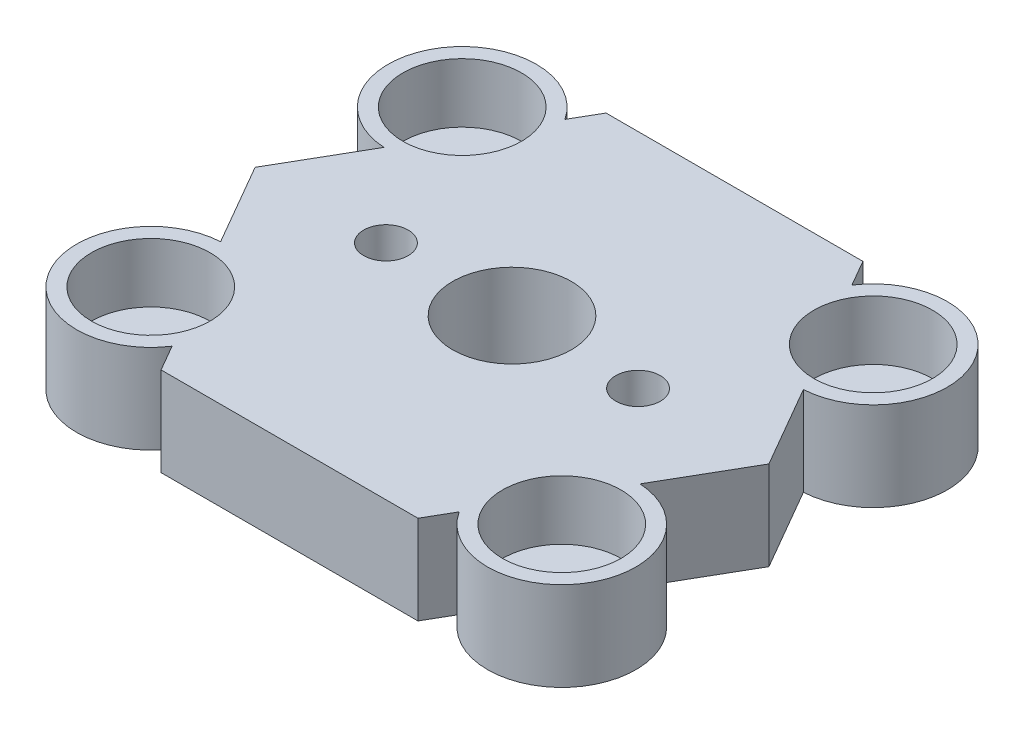
ISO-10303-21;
HEADER;
FILE_DESCRIPTION(('STEP AP214'),'2;1');
FILE_NAME('part.step','',(''),(''),'','','');
FILE_SCHEMA(('AUTOMOTIVE_DESIGN { 1 0 10303 214 1 1 1 1 }'));
ENDSEC;
DATA;
#1=APPLICATION_CONTEXT('core data for automotive mechanical design processes');
#2=APPLICATION_PROTOCOL_DEFINITION('international standard','automotive_design',2000,#1);
#3=PRODUCT_CONTEXT('',#1,'mechanical');
#4=PRODUCT('Part','Part','',(#3));
#5=PRODUCT_RELATED_PRODUCT_CATEGORY('part','',(#4));
#6=PRODUCT_DEFINITION_FORMATION('','',#4);
#7=PRODUCT_DEFINITION_CONTEXT('part definition',#1,'design');
#8=PRODUCT_DEFINITION('design','',#6,#7);
#9=PRODUCT_DEFINITION_SHAPE('','',#8);
#10=(LENGTH_UNIT() NAMED_UNIT(*) SI_UNIT(.MILLI.,.METRE.));
#11=(NAMED_UNIT(*) PLANE_ANGLE_UNIT() SI_UNIT($,.RADIAN.));
#12=(NAMED_UNIT(*) SI_UNIT($,.STERADIAN.) SOLID_ANGLE_UNIT());
#13=UNCERTAINTY_MEASURE_WITH_UNIT(LENGTH_MEASURE(1.E-05),#10,'distance_accuracy_value','');
#14=(GEOMETRIC_REPRESENTATION_CONTEXT(3) GLOBAL_UNCERTAINTY_ASSIGNED_CONTEXT((#13)) GLOBAL_UNIT_ASSIGNED_CONTEXT((#10,
#11,#12)) REPRESENTATION_CONTEXT('',''));
#15=CARTESIAN_POINT('',(0.,0.,0.));
#16=DIRECTION('',(0.,0.,1.));
#17=DIRECTION('',(1.,0.,0.));
#18=AXIS2_PLACEMENT_3D('',#15,#16,#17);
#19=CARTESIAN_POINT('',(-13.856406460551,6.,10.5));
#20=DIRECTION('',(0.,-1.,0.));
#21=DIRECTION('',(0.,0.,-1.));
#22=AXIS2_PLACEMENT_3D('',#19,#20,#21);
#23=CYLINDRICAL_SURFACE('',#22,1.5);
#24=CARTESIAN_POINT('',(-13.856406460551,0.,10.5));
#25=DIRECTION('',(0.,-1.,0.));
#26=DIRECTION('',(0.,0.,-1.));
#27=AXIS2_PLACEMENT_3D('',#24,#25,#26);
#28=CIRCLE('',#27,1.5);
#29=CARTESIAN_POINT('',(-13.856406460551,0.,9.));
#30=VERTEX_POINT('',#29);
#31=EDGE_CURVE('E500',#30,#30,#28,.T.);
#32=ORIENTED_EDGE('',*,*,#31,.T.);
#33=EDGE_LOOP('',(#32));
#34=FACE_BOUND('',#33,.T.);
#35=CARTESIAN_POINT('',(-13.856406460551,2.,10.5));
#36=DIRECTION('',(0.,1.,0.));
#37=DIRECTION('',(0.,0.,1.));
#38=AXIS2_PLACEMENT_3D('',#35,#36,#37);
#39=CIRCLE('',#38,1.5);
#40=CARTESIAN_POINT('',(-13.856406460551,2.,12.));
#41=VERTEX_POINT('',#40);
#42=EDGE_CURVE('E298',#41,#41,#39,.F.);
#43=ORIENTED_EDGE('',*,*,#42,.F.);
#44=EDGE_LOOP('',(#43));
#45=FACE_BOUND('',#44,.T.);
#46=ADVANCED_FACE('F294',(#34,#45),#23,.F.);
#47=CARTESIAN_POINT('',(13.856406460551,6.,10.5));
#48=DIRECTION('',(0.,-1.,0.));
#49=DIRECTION('',(0.,0.,-1.));
#50=AXIS2_PLACEMENT_3D('',#47,#48,#49);
#51=CYLINDRICAL_SURFACE('',#50,1.5);
#52=CARTESIAN_POINT('',(13.856406460551,0.,10.5));
#53=DIRECTION('',(0.,1.,0.));
#54=DIRECTION('',(0.,0.,1.));
#55=AXIS2_PLACEMENT_3D('',#52,#53,#54);
#56=CIRCLE('',#55,1.5);
#57=CARTESIAN_POINT('',(13.856406460551,0.,12.));
#58=VERTEX_POINT('',#57);
#59=EDGE_CURVE('E509',#58,#58,#56,.T.);
#60=ORIENTED_EDGE('',*,*,#59,.F.);
#61=EDGE_LOOP('',(#60));
#62=FACE_BOUND('',#61,.T.);
#63=CARTESIAN_POINT('',(13.856406460551,2.,10.5));
#64=DIRECTION('',(0.,1.,0.));
#65=DIRECTION('',(0.,0.,1.));
#66=AXIS2_PLACEMENT_3D('',#63,#64,#65);
#67=CIRCLE('',#66,1.5);
#68=CARTESIAN_POINT('',(13.856406460551,2.,12.));
#69=VERTEX_POINT('',#68);
#70=EDGE_CURVE('E537',#69,#69,#67,.T.);
#71=ORIENTED_EDGE('',*,*,#70,.T.);
#72=EDGE_LOOP('',(#71));
#73=FACE_BOUND('',#72,.T.);
#74=ADVANCED_FACE('F607',(#62,#73),#51,.F.);
#75=CARTESIAN_POINT('',(13.856406460551,6.,-10.5));
#76=DIRECTION('',(0.,-1.,0.));
#77=DIRECTION('',(0.,0.,-1.));
#78=AXIS2_PLACEMENT_3D('',#75,#76,#77);
#79=CYLINDRICAL_SURFACE('',#78,1.5);
#80=CARTESIAN_POINT('',(13.856406460551,0.,-10.5));
#81=DIRECTION('',(0.,-1.,0.));
#82=DIRECTION('',(0.,0.,-1.));
#83=AXIS2_PLACEMENT_3D('',#80,#81,#82);
#84=CIRCLE('',#83,1.5);
#85=CARTESIAN_POINT('',(13.856406460551,0.,-12.));
#86=VERTEX_POINT('',#85);
#87=EDGE_CURVE('E516',#86,#86,#84,.T.);
#88=ORIENTED_EDGE('',*,*,#87,.T.);
#89=EDGE_LOOP('',(#88));
#90=FACE_BOUND('',#89,.T.);
#91=CARTESIAN_POINT('',(13.856406460551,2.,-10.5));
#92=DIRECTION('',(0.,1.,0.));
#93=DIRECTION('',(0.,0.,1.));
#94=AXIS2_PLACEMENT_3D('',#91,#92,#93);
#95=CIRCLE('',#94,1.5);
#96=CARTESIAN_POINT('',(13.856406460551,2.,-9.));
#97=VERTEX_POINT('',#96);
#98=EDGE_CURVE('E534',#97,#97,#95,.F.);
#99=ORIENTED_EDGE('',*,*,#98,.F.);
#100=EDGE_LOOP('',(#99));
#101=FACE_BOUND('',#100,.T.);
#102=ADVANCED_FACE('F613',(#90,#101),#79,.F.);
#103=CARTESIAN_POINT('',(-13.856406460551,6.,-10.5));
#104=DIRECTION('',(0.,-1.,0.));
#105=DIRECTION('',(0.,0.,-1.));
#106=AXIS2_PLACEMENT_3D('',#103,#104,#105);
#107=CYLINDRICAL_SURFACE('',#106,1.5);
#108=CARTESIAN_POINT('',(-13.856406460551,0.,-10.5));
#109=DIRECTION('',(0.,1.,0.));
#110=DIRECTION('',(0.,0.,1.));
#111=AXIS2_PLACEMENT_3D('',#108,#109,#110);
#112=CIRCLE('',#111,1.5);
#113=CARTESIAN_POINT('',(-13.856406460551,0.,-9.));
#114=VERTEX_POINT('',#113);
#115=EDGE_CURVE('E424',#114,#114,#112,.T.);
#116=ORIENTED_EDGE('',*,*,#115,.F.);
#117=EDGE_LOOP('',(#116));
#118=FACE_BOUND('',#117,.T.);
#119=CARTESIAN_POINT('',(-13.856406460551,2.,-10.5));
#120=DIRECTION('',(0.,1.,0.));
#121=DIRECTION('',(0.,0.,1.));
#122=AXIS2_PLACEMENT_3D('',#119,#120,#121);
#123=CIRCLE('',#122,1.5);
#124=CARTESIAN_POINT('',(-13.856406460551,2.,-9.));
#125=VERTEX_POINT('',#124);
#126=EDGE_CURVE('E531',#125,#125,#123,.T.);
#127=ORIENTED_EDGE('',*,*,#126,.T.);
#128=EDGE_LOOP('',(#127));
#129=FACE_BOUND('',#128,.T.);
#130=ADVANCED_FACE('F629',(#118,#129),#107,.F.);
#131=CARTESIAN_POINT('',(-8.5,6.,0.));
#132=DIRECTION('',(0.,-1.,0.));
#133=DIRECTION('',(0.,0.,-1.));
#134=AXIS2_PLACEMENT_3D('',#131,#132,#133);
#135=CYLINDRICAL_SURFACE('',#134,1.5);
#136=CARTESIAN_POINT('',(-8.5,6.,0.));
#137=DIRECTION('',(0.,1.,0.));
#138=DIRECTION('',(0.,0.,1.));
#139=AXIS2_PLACEMENT_3D('',#136,#137,#138);
#140=CIRCLE('',#139,1.5);
#141=CARTESIAN_POINT('',(-8.5,6.,1.5));
#142=VERTEX_POINT('',#141);
#143=EDGE_CURVE('E429',#142,#142,#140,.T.);
#144=ORIENTED_EDGE('',*,*,#143,.T.);
#145=EDGE_LOOP('',(#144));
#146=FACE_BOUND('',#145,.T.);
#147=CARTESIAN_POINT('',(-8.5,3.,0.));
#148=DIRECTION('',(0.,-1.,0.));
#149=DIRECTION('',(0.,0.,-1.));
#150=AXIS2_PLACEMENT_3D('',#147,#148,#149);
#151=CIRCLE('',#150,1.5);
#152=CARTESIAN_POINT('',(-8.5,3.,-1.5));
#153=VERTEX_POINT('',#152);
#154=EDGE_CURVE('E520',#153,#153,#151,.T.);
#155=ORIENTED_EDGE('',*,*,#154,.T.);
#156=EDGE_LOOP('',(#155));
#157=FACE_BOUND('',#156,.T.);
#158=ADVANCED_FACE('F634',(#146,#157),#135,.F.);
#159=CARTESIAN_POINT('',(8.5,6.,0.));
#160=DIRECTION('',(0.,-1.,0.));
#161=DIRECTION('',(0.,0.,-1.));
#162=AXIS2_PLACEMENT_3D('',#159,#160,#161);
#163=CYLINDRICAL_SURFACE('',#162,1.5);
#164=CARTESIAN_POINT('',(8.5,6.,0.));
#165=DIRECTION('',(0.,1.,0.));
#166=DIRECTION('',(0.,0.,1.));
#167=AXIS2_PLACEMENT_3D('',#164,#165,#166);
#168=CIRCLE('',#167,1.5);
#169=CARTESIAN_POINT('',(8.5,6.,1.5));
#170=VERTEX_POINT('',#169);
#171=EDGE_CURVE('E432',#170,#170,#168,.T.);
#172=ORIENTED_EDGE('',*,*,#171,.T.);
#173=EDGE_LOOP('',(#172));
#174=FACE_BOUND('',#173,.T.);
#175=CARTESIAN_POINT('',(8.5,3.,0.));
#176=DIRECTION('',(0.,-1.,0.));
#177=DIRECTION('',(0.,0.,-1.));
#178=AXIS2_PLACEMENT_3D('',#175,#176,#177);
#179=CIRCLE('',#178,1.5);
#180=CARTESIAN_POINT('',(8.5,3.,-1.5));
#181=VERTEX_POINT('',#180);
#182=EDGE_CURVE('E525',#181,#181,#179,.T.);
#183=ORIENTED_EDGE('',*,*,#182,.T.);
#184=EDGE_LOOP('',(#183));
#185=FACE_BOUND('',#184,.T.);
#186=ADVANCED_FACE('F624',(#174,#185),#163,.F.);
#187=CARTESIAN_POINT('',(-13.856406460551,6.,10.5));
#188=DIRECTION('',(0.,-1.,0.));
#189=DIRECTION('',(0.,0.,-1.));
#190=AXIS2_PLACEMENT_3D('',#187,#188,#189);
#191=CYLINDRICAL_SURFACE('',#190,5.);
#192=DIRECTION('',(0.,-1.,0.));
#193=VECTOR('',#192,1.);
#194=CARTESIAN_POINT('',(-9.67527791459956,6.,13.2419270745645));
#195=LINE('',#194,#193);
#196=CARTESIAN_POINT('',(-9.67527791459956,6.,13.2419270745645));
#197=VERTEX_POINT('',#196);
#198=CARTESIAN_POINT('',(-9.67527791459956,0.,13.2419270745645));
#199=VERTEX_POINT('',#198);
#200=EDGE_CURVE('E492',#197,#199,#195,.T.);
#201=ORIENTED_EDGE('',*,*,#200,.F.);
#202=CARTESIAN_POINT('',(-13.856406460551,6.,10.5));
#203=DIRECTION('',(0.,-1.,0.));
#204=DIRECTION('',(0.,0.,-1.));
#205=AXIS2_PLACEMENT_3D('',#202,#203,#204);
#206=CIRCLE('',#205,5.);
#207=CARTESIAN_POINT('',(-14.1404206894725,6.,5.50807292543548));
#208=VERTEX_POINT('',#207);
#209=EDGE_CURVE('E433',#197,#208,#206,.T.);
#210=ORIENTED_EDGE('',*,*,#209,.T.);
#211=DIRECTION('',(0.,-1.,0.));
#212=VECTOR('',#211,1.);
#213=CARTESIAN_POINT('',(-14.1404206894725,6.,5.50807292543548));
#214=LINE('',#213,#212);
#215=CARTESIAN_POINT('',(-14.1404206894725,0.,5.50807292543548));
#216=VERTEX_POINT('',#215);
#217=EDGE_CURVE('E490',#216,#208,#214,.F.);
#218=ORIENTED_EDGE('',*,*,#217,.F.);
#219=CARTESIAN_POINT('',(-13.856406460551,0.,10.5));
#220=DIRECTION('',(0.,-1.,0.));
#221=DIRECTION('',(0.,0.,-1.));
#222=AXIS2_PLACEMENT_3D('',#219,#220,#221);
#223=CIRCLE('',#222,5.);
#224=EDGE_CURVE('E503',#199,#216,#223,.T.);
#225=ORIENTED_EDGE('',*,*,#224,.F.);
#226=EDGE_LOOP('',(#201,#210,#218,#225));
#227=FACE_BOUND('',#226,.T.);
#228=ADVANCED_FACE('F621',(#227),#191,.T.);
#229=CARTESIAN_POINT('',(13.856406460551,6.,10.5));
#230=DIRECTION('',(0.,-1.,0.));
#231=DIRECTION('',(0.,0.,-1.));
#232=AXIS2_PLACEMENT_3D('',#229,#230,#231);
#233=CYLINDRICAL_SURFACE('',#232,5.);
#234=CARTESIAN_POINT('',(13.856406460551,0.,10.5));
#235=DIRECTION('',(0.,1.,0.));
#236=DIRECTION('',(0.,0.,1.));
#237=AXIS2_PLACEMENT_3D('',#234,#235,#236);
#238=CIRCLE('',#237,5.);
#239=CARTESIAN_POINT('',(9.67527791459957,0.,13.2419270745645));
#240=VERTEX_POINT('',#239);
#241=CARTESIAN_POINT('',(14.1404206894725,0.,5.50807292543549));
#242=VERTEX_POINT('',#241);
#243=EDGE_CURVE('E512',#240,#242,#238,.T.);
#244=ORIENTED_EDGE('',*,*,#243,.T.);
#245=DIRECTION('',(0.,-1.,0.));
#246=VECTOR('',#245,1.);
#247=CARTESIAN_POINT('',(14.1404206894725,6.,5.5080729254355));
#248=LINE('',#247,#246);
#249=CARTESIAN_POINT('',(14.1404206894725,6.,5.50807292543549));
#250=VERTEX_POINT('',#249);
#251=EDGE_CURVE('E393',#242,#250,#248,.F.);
#252=ORIENTED_EDGE('',*,*,#251,.T.);
#253=CARTESIAN_POINT('',(13.856406460551,6.,10.5));
#254=DIRECTION('',(0.,1.,0.));
#255=DIRECTION('',(0.,0.,1.));
#256=AXIS2_PLACEMENT_3D('',#253,#254,#255);
#257=CIRCLE('',#256,5.);
#258=CARTESIAN_POINT('',(9.67527791459957,6.,13.2419270745645));
#259=VERTEX_POINT('',#258);
#260=EDGE_CURVE('E504',#259,#250,#257,.T.);
#261=ORIENTED_EDGE('',*,*,#260,.F.);
#262=DIRECTION('',(0.,-1.,0.));
#263=VECTOR('',#262,1.);
#264=CARTESIAN_POINT('',(9.67527791459957,6.,13.2419270745645));
#265=LINE('',#264,#263);
#266=EDGE_CURVE('E387',#259,#240,#265,.T.);
#267=ORIENTED_EDGE('',*,*,#266,.T.);
#268=EDGE_LOOP('',(#244,#252,#261,#267));
#269=FACE_BOUND('',#268,.T.);
#270=ADVANCED_FACE('F623',(#269),#233,.T.);
#271=CARTESIAN_POINT('',(13.856406460551,6.,-10.5));
#272=DIRECTION('',(0.,-1.,0.));
#273=DIRECTION('',(0.,0.,-1.));
#274=AXIS2_PLACEMENT_3D('',#271,#272,#273);
#275=CYLINDRICAL_SURFACE('',#274,5.);
#276=DIRECTION('',(0.,-1.,0.));
#277=VECTOR('',#276,1.);
#278=CARTESIAN_POINT('',(9.67527791459956,6.,-13.2419270745645));
#279=LINE('',#278,#277);
#280=CARTESIAN_POINT('',(9.67527791459956,6.,-13.2419270745645));
#281=VERTEX_POINT('',#280);
#282=CARTESIAN_POINT('',(9.67527791459956,0.,-13.2419270745645));
#283=VERTEX_POINT('',#282);
#284=EDGE_CURVE('E496',#281,#283,#279,.T.);
#285=ORIENTED_EDGE('',*,*,#284,.F.);
#286=CARTESIAN_POINT('',(13.856406460551,6.,-10.5));
#287=DIRECTION('',(0.,-1.,0.));
#288=DIRECTION('',(0.,0.,-1.));
#289=AXIS2_PLACEMENT_3D('',#286,#287,#288);
#290=CIRCLE('',#289,5.);
#291=CARTESIAN_POINT('',(14.1404206894725,6.,-5.50807292543549));
#292=VERTEX_POINT('',#291);
#293=EDGE_CURVE('E513',#281,#292,#290,.T.);
#294=ORIENTED_EDGE('',*,*,#293,.T.);
#295=DIRECTION('',(0.,-1.,0.));
#296=VECTOR('',#295,1.);
#297=CARTESIAN_POINT('',(14.1404206894725,6.,-5.50807292543549));
#298=LINE('',#297,#296);
#299=CARTESIAN_POINT('',(14.1404206894725,0.,-5.50807292543549));
#300=VERTEX_POINT('',#299);
#301=EDGE_CURVE('E494',#300,#292,#298,.F.);
#302=ORIENTED_EDGE('',*,*,#301,.F.);
#303=CARTESIAN_POINT('',(13.856406460551,0.,-10.5));
#304=DIRECTION('',(0.,-1.,0.));
#305=DIRECTION('',(0.,0.,-1.));
#306=AXIS2_PLACEMENT_3D('',#303,#304,#305);
#307=CIRCLE('',#306,5.);
#308=EDGE_CURVE('E519',#283,#300,#307,.T.);
#309=ORIENTED_EDGE('',*,*,#308,.F.);
#310=EDGE_LOOP('',(#285,#294,#302,#309));
#311=FACE_BOUND('',#310,.T.);
#312=ADVANCED_FACE('F296',(#311),#275,.T.);
#313=CARTESIAN_POINT('',(0.,6.,0.));
#314=DIRECTION('',(0.,-1.,0.));
#315=DIRECTION('',(0.,0.,-1.));
#316=AXIS2_PLACEMENT_3D('',#313,#314,#315);
#317=CYLINDRICAL_SURFACE('',#316,4.);
#318=CARTESIAN_POINT('',(0.,6.,0.));
#319=DIRECTION('',(0.,1.,0.));
#320=DIRECTION('',(0.,0.,1.));
#321=AXIS2_PLACEMENT_3D('',#318,#319,#320);
#322=CIRCLE('',#321,4.);
#323=CARTESIAN_POINT('',(0.,6.,4.));
#324=VERTEX_POINT('',#323);
#325=EDGE_CURVE('E437',#324,#324,#322,.T.);
#326=ORIENTED_EDGE('',*,*,#325,.T.);
#327=EDGE_LOOP('',(#326));
#328=FACE_BOUND('',#327,.T.);
#329=CARTESIAN_POINT('',(0.,0.,0.));
#330=DIRECTION('',(0.,1.,0.));
#331=DIRECTION('',(0.,0.,1.));
#332=AXIS2_PLACEMENT_3D('',#329,#330,#331);
#333=CIRCLE('',#332,4.);
#334=CARTESIAN_POINT('',(0.,0.,4.));
#335=VERTEX_POINT('',#334);
#336=EDGE_CURVE('E436',#335,#335,#333,.T.);
#337=ORIENTED_EDGE('',*,*,#336,.F.);
#338=EDGE_LOOP('',(#337));
#339=FACE_BOUND('',#338,.T.);
#340=ADVANCED_FACE('F870',(#328,#339),#317,.F.);
#341=CARTESIAN_POINT('',(-17.3205080756888,6.,0.));
#342=DIRECTION('',(0.866025403784438,0.,-0.5));
#343=DIRECTION('',(-0.5,0.,-0.866025403784439));
#344=AXIS2_PLACEMENT_3D('',#341,#342,#343);
#345=PLANE('',#344);
#346=DIRECTION('',(0.5,0.,0.866025403784438));
#347=VECTOR('',#346,1.);
#348=CARTESIAN_POINT('',(-17.3205080756888,0.,0.));
#349=LINE('',#348,#347);
#350=CARTESIAN_POINT('',(-17.3205080756888,0.,0.));
#351=VERTEX_POINT('',#350);
#352=EDGE_CURVE('E470',#351,#216,#349,.T.);
#353=ORIENTED_EDGE('',*,*,#352,.T.);
#354=ORIENTED_EDGE('',*,*,#217,.T.);
#355=DIRECTION('',(0.5,0.,0.866025403784438));
#356=VECTOR('',#355,1.);
#357=CARTESIAN_POINT('',(-17.3205080756888,6.,0.));
#358=LINE('',#357,#356);
#359=CARTESIAN_POINT('',(-17.3205080756888,6.,0.));
#360=VERTEX_POINT('',#359);
#361=EDGE_CURVE('E453',#360,#208,#358,.T.);
#362=ORIENTED_EDGE('',*,*,#361,.F.);
#363=DIRECTION('',(0.,-1.,0.));
#364=VECTOR('',#363,1.);
#365=CARTESIAN_POINT('',(-17.3205080756888,6.,0.));
#366=LINE('',#365,#364);
#367=EDGE_CURVE('E413',#360,#351,#366,.T.);
#368=ORIENTED_EDGE('',*,*,#367,.T.);
#369=EDGE_LOOP('',(#353,#354,#362,#368));
#370=FACE_BOUND('',#369,.T.);
#371=ADVANCED_FACE('F860',(#370),#345,.F.);
#372=CARTESIAN_POINT('',(-8.66025403784438,6.,15.));
#373=VERTEX_POINT('',#372);
#374=EDGE_CURVE('E452',#197,#373,#358,.T.);
#375=ORIENTED_EDGE('',*,*,#374,.F.);
#376=ORIENTED_EDGE('',*,*,#200,.T.);
#377=CARTESIAN_POINT('',(-8.66025403784438,0.,15.));
#378=VERTEX_POINT('',#377);
#379=EDGE_CURVE('E469',#199,#378,#349,.T.);
#380=ORIENTED_EDGE('',*,*,#379,.T.);
#381=DIRECTION('',(0.,-1.,0.));
#382=VECTOR('',#381,1.);
#383=CARTESIAN_POINT('',(-8.66025403784438,6.,15.));
#384=LINE('',#383,#382);
#385=EDGE_CURVE('E477',#373,#378,#384,.T.);
#386=ORIENTED_EDGE('',*,*,#385,.F.);
#387=EDGE_LOOP('',(#375,#376,#380,#386));
#388=FACE_BOUND('',#387,.T.);
#389=ADVANCED_FACE('F850',(#388),#345,.F.);
#390=CARTESIAN_POINT('',(-8.66025403784438,6.,15.));
#391=DIRECTION('',(0.,0.,-1.));
#392=DIRECTION('',(-1.,0.,0.));
#393=AXIS2_PLACEMENT_3D('',#390,#391,#392);
#394=PLANE('',#393);
#395=DIRECTION('',(1.,0.,0.));
#396=VECTOR('',#395,1.);
#397=CARTESIAN_POINT('',(-8.66025403784438,0.,15.));
#398=LINE('',#397,#396);
#399=CARTESIAN_POINT('',(8.66025403784439,0.,15.));
#400=VERTEX_POINT('',#399);
#401=EDGE_CURVE('E473',#378,#400,#398,.T.);
#402=ORIENTED_EDGE('',*,*,#401,.T.);
#403=DIRECTION('',(0.,-1.,0.));
#404=VECTOR('',#403,1.);
#405=CARTESIAN_POINT('',(8.66025403784439,6.,15.));
#406=LINE('',#405,#404);
#407=CARTESIAN_POINT('',(8.66025403784439,6.,15.));
#408=VERTEX_POINT('',#407);
#409=EDGE_CURVE('E457',#408,#400,#406,.T.);
#410=ORIENTED_EDGE('',*,*,#409,.F.);
#411=DIRECTION('',(1.,0.,0.));
#412=VECTOR('',#411,1.);
#413=CARTESIAN_POINT('',(-8.66025403784438,6.,15.));
#414=LINE('',#413,#412);
#415=EDGE_CURVE('E455',#373,#408,#414,.T.);
#416=ORIENTED_EDGE('',*,*,#415,.F.);
#417=ORIENTED_EDGE('',*,*,#385,.T.);
#418=EDGE_LOOP('',(#402,#410,#416,#417));
#419=FACE_BOUND('',#418,.T.);
#420=ADVANCED_FACE('F842',(#419),#394,.F.);
#421=CARTESIAN_POINT('',(8.66025403784439,6.,15.));
#422=DIRECTION('',(-0.866025403784439,0.,-0.5));
#423=DIRECTION('',(-0.5,0.,0.866025403784439));
#424=AXIS2_PLACEMENT_3D('',#421,#422,#423);
#425=PLANE('',#424);
#426=ORIENTED_EDGE('',*,*,#266,.F.);
#427=DIRECTION('',(0.5,0.,-0.866025403784439));
#428=VECTOR('',#427,1.);
#429=CARTESIAN_POINT('',(8.66025403784439,6.,15.));
#430=LINE('',#429,#428);
#431=EDGE_CURVE('E443',#408,#259,#430,.T.);
#432=ORIENTED_EDGE('',*,*,#431,.F.);
#433=ORIENTED_EDGE('',*,*,#409,.T.);
#434=DIRECTION('',(0.5,0.,-0.866025403784439));
#435=VECTOR('',#434,1.);
#436=CARTESIAN_POINT('',(8.66025403784439,0.,15.));
#437=LINE('',#436,#435);
#438=EDGE_CURVE('E458',#400,#240,#437,.T.);
#439=ORIENTED_EDGE('',*,*,#438,.T.);
#440=EDGE_LOOP('',(#426,#432,#433,#439));
#441=FACE_BOUND('',#440,.T.);
#442=ADVANCED_FACE('F833',(#441),#425,.F.);
#443=ORIENTED_EDGE('',*,*,#251,.F.);
#444=CARTESIAN_POINT('',(17.3205080756888,0.,0.));
#445=VERTEX_POINT('',#444);
#446=EDGE_CURVE('E440',#242,#445,#437,.T.);
#447=ORIENTED_EDGE('',*,*,#446,.T.);
#448=DIRECTION('',(0.,-1.,0.));
#449=VECTOR('',#448,1.);
#450=CARTESIAN_POINT('',(17.3205080756888,6.,0.));
#451=LINE('',#450,#449);
#452=CARTESIAN_POINT('',(17.3205080756888,6.,0.));
#453=VERTEX_POINT('',#452);
#454=EDGE_CURVE('E487',#453,#445,#451,.T.);
#455=ORIENTED_EDGE('',*,*,#454,.F.);
#456=EDGE_CURVE('E447',#250,#453,#430,.T.);
#457=ORIENTED_EDGE('',*,*,#456,.F.);
#458=EDGE_LOOP('',(#443,#447,#455,#457));
#459=FACE_BOUND('',#458,.T.);
#460=ADVANCED_FACE('F619',(#459),#425,.F.);
#461=CARTESIAN_POINT('',(17.3205080756888,6.,0.));
#462=DIRECTION('',(-0.866025403784438,0.,0.5));
#463=DIRECTION('',(0.5,0.,0.866025403784439));
#464=AXIS2_PLACEMENT_3D('',#461,#462,#463);
#465=PLANE('',#464);
#466=DIRECTION('',(-0.5,0.,-0.866025403784438));
#467=VECTOR('',#466,1.);
#468=CARTESIAN_POINT('',(17.3205080756888,0.,0.));
#469=LINE('',#468,#467);
#470=EDGE_CURVE('E461',#445,#300,#469,.T.);
#471=ORIENTED_EDGE('',*,*,#470,.T.);
#472=ORIENTED_EDGE('',*,*,#301,.T.);
#473=DIRECTION('',(-0.5,0.,-0.866025403784438));
#474=VECTOR('',#473,1.);
#475=CARTESIAN_POINT('',(17.3205080756888,6.,0.));
#476=LINE('',#475,#474);
#477=EDGE_CURVE('E448',#453,#292,#476,.T.);
#478=ORIENTED_EDGE('',*,*,#477,.F.);
#479=ORIENTED_EDGE('',*,*,#454,.T.);
#480=EDGE_LOOP('',(#471,#472,#478,#479));
#481=FACE_BOUND('',#480,.T.);
#482=ADVANCED_FACE('F816',(#481),#465,.F.);
#483=CARTESIAN_POINT('',(8.66025403784438,6.,-15.));
#484=VERTEX_POINT('',#483);
#485=EDGE_CURVE('E446',#281,#484,#476,.T.);
#486=ORIENTED_EDGE('',*,*,#485,.F.);
#487=ORIENTED_EDGE('',*,*,#284,.T.);
#488=CARTESIAN_POINT('',(8.66025403784438,0.,-15.));
#489=VERTEX_POINT('',#488);
#490=EDGE_CURVE('E460',#283,#489,#469,.T.);
#491=ORIENTED_EDGE('',*,*,#490,.T.);
#492=DIRECTION('',(0.,-1.,0.));
#493=VECTOR('',#492,1.);
#494=CARTESIAN_POINT('',(8.66025403784438,6.,-15.));
#495=LINE('',#494,#493);
#496=EDGE_CURVE('E484',#484,#489,#495,.T.);
#497=ORIENTED_EDGE('',*,*,#496,.F.);
#498=EDGE_LOOP('',(#486,#487,#491,#497));
#499=FACE_BOUND('',#498,.T.);
#500=ADVANCED_FACE('F806',(#499),#465,.F.);
#501=CARTESIAN_POINT('',(8.66025403784438,6.,-15.));
#502=DIRECTION('',(0.,0.,1.));
#503=DIRECTION('',(1.,0.,0.));
#504=AXIS2_PLACEMENT_3D('',#501,#502,#503);
#505=PLANE('',#504);
#506=DIRECTION('',(-1.,0.,0.));
#507=VECTOR('',#506,1.);
#508=CARTESIAN_POINT('',(8.66025403784438,0.,-15.));
#509=LINE('',#508,#507);
#510=CARTESIAN_POINT('',(-8.66025403784438,0.,-15.));
#511=VERTEX_POINT('',#510);
#512=EDGE_CURVE('E464',#489,#511,#509,.T.);
#513=ORIENTED_EDGE('',*,*,#512,.T.);
#514=DIRECTION('',(0.,-1.,0.));
#515=VECTOR('',#514,1.);
#516=CARTESIAN_POINT('',(-8.66025403784438,6.,-15.));
#517=LINE('',#516,#515);
#518=CARTESIAN_POINT('',(-8.66025403784438,6.,-15.));
#519=VERTEX_POINT('',#518);
#520=EDGE_CURVE('E481',#519,#511,#517,.T.);
#521=ORIENTED_EDGE('',*,*,#520,.F.);
#522=DIRECTION('',(-1.,0.,0.));
#523=VECTOR('',#522,1.);
#524=CARTESIAN_POINT('',(8.66025403784438,6.,-15.));
#525=LINE('',#524,#523);
#526=EDGE_CURVE('E418',#484,#519,#525,.T.);
#527=ORIENTED_EDGE('',*,*,#526,.F.);
#528=ORIENTED_EDGE('',*,*,#496,.T.);
#529=EDGE_LOOP('',(#513,#521,#527,#528));
#530=FACE_BOUND('',#529,.T.);
#531=ADVANCED_FACE('F798',(#530),#505,.F.);
#532=CARTESIAN_POINT('',(-8.66025403784438,6.,-15.));
#533=DIRECTION('',(0.866025403784438,0.,0.5));
#534=DIRECTION('',(0.5,0.,-0.866025403784439));
#535=AXIS2_PLACEMENT_3D('',#532,#533,#534);
#536=PLANE('',#535);
#537=DIRECTION('',(-0.5,0.,0.866025403784439));
#538=VECTOR('',#537,1.);
#539=CARTESIAN_POINT('',(-8.66025403784438,0.,-15.));
#540=LINE('',#539,#538);
#541=CARTESIAN_POINT('',(-9.67527791459956,0.,-13.2419270745645));
#542=VERTEX_POINT('',#541);
#543=EDGE_CURVE('E467',#511,#542,#540,.T.);
#544=ORIENTED_EDGE('',*,*,#543,.T.);
#545=DIRECTION('',(0.,-1.,0.));
#546=VECTOR('',#545,1.);
#547=CARTESIAN_POINT('',(-9.67527791459956,6.,-13.2419270745645));
#548=LINE('',#547,#546);
#549=CARTESIAN_POINT('',(-9.67527791459956,6.,-13.2419270745645));
#550=VERTEX_POINT('',#549);
#551=EDGE_CURVE('E304',#542,#550,#548,.F.);
#552=ORIENTED_EDGE('',*,*,#551,.T.);
#553=DIRECTION('',(-0.5,0.,0.866025403784439));
#554=VECTOR('',#553,1.);
#555=CARTESIAN_POINT('',(-8.66025403784438,6.,-15.));
#556=LINE('',#555,#554);
#557=EDGE_CURVE('E417',#519,#550,#556,.T.);
#558=ORIENTED_EDGE('',*,*,#557,.F.);
#559=ORIENTED_EDGE('',*,*,#520,.T.);
#560=EDGE_LOOP('',(#544,#552,#558,#559));
#561=FACE_BOUND('',#560,.T.);
#562=ADVANCED_FACE('F789',(#561),#536,.F.);
#563=CARTESIAN_POINT('',(-14.1404206894725,6.,-5.50807292543549));
#564=VERTEX_POINT('',#563);
#565=EDGE_CURVE('E410',#564,#360,#556,.T.);
#566=ORIENTED_EDGE('',*,*,#565,.F.);
#567=DIRECTION('',(0.,-1.,0.));
#568=VECTOR('',#567,1.);
#569=CARTESIAN_POINT('',(-14.1404206894725,6.,-5.50807292543549));
#570=LINE('',#569,#568);
#571=CARTESIAN_POINT('',(-14.1404206894725,0.,-5.50807292543549));
#572=VERTEX_POINT('',#571);
#573=EDGE_CURVE('E12',#564,#572,#570,.T.);
#574=ORIENTED_EDGE('',*,*,#573,.T.);
#575=EDGE_CURVE('E466',#572,#351,#540,.T.);
#576=ORIENTED_EDGE('',*,*,#575,.T.);
#577=ORIENTED_EDGE('',*,*,#367,.F.);
#578=EDGE_LOOP('',(#566,#574,#576,#577));
#579=FACE_BOUND('',#578,.T.);
#580=ADVANCED_FACE('F411',(#579),#536,.F.);
#581=CARTESIAN_POINT('',(-13.856406460551,6.,-10.5));
#582=DIRECTION('',(0.,-1.,0.));
#583=DIRECTION('',(0.,0.,-1.));
#584=AXIS2_PLACEMENT_3D('',#581,#582,#583);
#585=CYLINDRICAL_SURFACE('',#584,5.);
#586=ORIENTED_EDGE('',*,*,#573,.F.);
#587=CARTESIAN_POINT('',(-13.856406460551,6.,-10.5));
#588=DIRECTION('',(0.,1.,0.));
#589=DIRECTION('',(0.,0.,1.));
#590=AXIS2_PLACEMENT_3D('',#587,#588,#589);
#591=CIRCLE('',#590,5.);
#592=EDGE_CURVE('E406',#550,#564,#591,.T.);
#593=ORIENTED_EDGE('',*,*,#592,.F.);
#594=ORIENTED_EDGE('',*,*,#551,.F.);
#595=CARTESIAN_POINT('',(-13.856406460551,0.,-10.5));
#596=DIRECTION('',(0.,1.,0.));
#597=DIRECTION('',(0.,0.,1.));
#598=AXIS2_PLACEMENT_3D('',#595,#596,#597);
#599=CIRCLE('',#598,5.);
#600=EDGE_CURVE('E408',#542,#572,#599,.T.);
#601=ORIENTED_EDGE('',*,*,#600,.T.);
#602=EDGE_LOOP('',(#586,#593,#594,#601));
#603=FACE_BOUND('',#602,.T.);
#604=ADVANCED_FACE('F404',(#603),#585,.T.);
#605=CARTESIAN_POINT('',(-13.856406460551,6.,-10.5));
#606=DIRECTION('',(0.,1.,0.));
#607=DIRECTION('',(0.,0.,1.));
#608=AXIS2_PLACEMENT_3D('',#605,#606,#607);
#609=PLANE('',#608);
#610=CARTESIAN_POINT('',(13.856406460551,6.,-10.5));
#611=DIRECTION('',(0.,1.,0.));
#612=DIRECTION('',(0.,0.,1.));
#613=AXIS2_PLACEMENT_3D('',#610,#611,#612);
#614=CIRCLE('',#613,4.);
#615=CARTESIAN_POINT('',(13.856406460551,6.,-6.5));
#616=VERTEX_POINT('',#615);
#617=EDGE_CURVE('E560',#616,#616,#614,.T.);
#618=ORIENTED_EDGE('',*,*,#617,.F.);
#619=EDGE_LOOP('',(#618));
#620=FACE_BOUND('',#619,.T.);
#621=CARTESIAN_POINT('',(-13.856406460551,6.,10.5));
#622=DIRECTION('',(0.,1.,0.));
#623=DIRECTION('',(0.,0.,1.));
#624=AXIS2_PLACEMENT_3D('',#621,#622,#623);
#625=CIRCLE('',#624,4.);
#626=CARTESIAN_POINT('',(-13.856406460551,6.,14.5));
#627=VERTEX_POINT('',#626);
#628=EDGE_CURVE('E566',#627,#627,#625,.T.);
#629=ORIENTED_EDGE('',*,*,#628,.F.);
#630=EDGE_LOOP('',(#629));
#631=FACE_BOUND('',#630,.T.);
#632=CARTESIAN_POINT('',(13.856406460551,6.,10.5));
#633=DIRECTION('',(0.,1.,0.));
#634=DIRECTION('',(0.,0.,1.));
#635=AXIS2_PLACEMENT_3D('',#632,#633,#634);
#636=CIRCLE('',#635,4.);
#637=CARTESIAN_POINT('',(13.856406460551,6.,14.5));
#638=VERTEX_POINT('',#637);
#639=EDGE_CURVE('E567',#638,#638,#636,.T.);
#640=ORIENTED_EDGE('',*,*,#639,.F.);
#641=EDGE_LOOP('',(#640));
#642=FACE_BOUND('',#641,.T.);
#643=CARTESIAN_POINT('',(-13.856406460551,6.,-10.5));
#644=DIRECTION('',(0.,1.,0.));
#645=DIRECTION('',(0.,0.,1.));
#646=AXIS2_PLACEMENT_3D('',#643,#644,#645);
#647=CIRCLE('',#646,4.);
#648=CARTESIAN_POINT('',(-13.856406460551,6.,-6.49999999999999));
#649=VERTEX_POINT('',#648);
#650=EDGE_CURVE('E557',#649,#649,#647,.T.);
#651=ORIENTED_EDGE('',*,*,#650,.F.);
#652=EDGE_LOOP('',(#651));
#653=FACE_BOUND('',#652,.T.);
#654=ORIENTED_EDGE('',*,*,#592,.T.);
#655=ORIENTED_EDGE('',*,*,#565,.T.);
#656=ORIENTED_EDGE('',*,*,#361,.T.);
#657=ORIENTED_EDGE('',*,*,#209,.F.);
#658=ORIENTED_EDGE('',*,*,#374,.T.);
#659=ORIENTED_EDGE('',*,*,#415,.T.);
#660=ORIENTED_EDGE('',*,*,#431,.T.);
#661=ORIENTED_EDGE('',*,*,#260,.T.);
#662=ORIENTED_EDGE('',*,*,#456,.T.);
#663=ORIENTED_EDGE('',*,*,#477,.T.);
#664=ORIENTED_EDGE('',*,*,#293,.F.);
#665=ORIENTED_EDGE('',*,*,#485,.T.);
#666=ORIENTED_EDGE('',*,*,#526,.T.);
#667=ORIENTED_EDGE('',*,*,#557,.T.);
#668=EDGE_LOOP('',(#654,#655,#656,#657,#658,#659,#660,#661,#662,#663,#664,#665,#666,#667));
#669=FACE_BOUND('',#668,.T.);
#670=ORIENTED_EDGE('',*,*,#171,.F.);
#671=EDGE_LOOP('',(#670));
#672=FACE_BOUND('',#671,.T.);
#673=ORIENTED_EDGE('',*,*,#325,.F.);
#674=EDGE_LOOP('',(#673));
#675=FACE_BOUND('',#674,.T.);
#676=ORIENTED_EDGE('',*,*,#143,.F.);
#677=EDGE_LOOP('',(#676));
#678=FACE_BOUND('',#677,.T.);
#679=ADVANCED_FACE('F420',(#620,#631,#642,#653,#669,#672,#675,#678),#609,.T.);
#680=CARTESIAN_POINT('',(-13.856406460551,0.,-10.5));
#681=DIRECTION('',(0.,1.,0.));
#682=DIRECTION('',(0.,0.,1.));
#683=AXIS2_PLACEMENT_3D('',#680,#681,#682);
#684=PLANE('',#683);
#685=CARTESIAN_POINT('',(-8.5,0.,0.));
#686=DIRECTION('',(0.,-1.,0.));
#687=DIRECTION('',(0.,0.,-1.));
#688=AXIS2_PLACEMENT_3D('',#685,#686,#687);
#689=CIRCLE('',#688,3.5);
#690=CARTESIAN_POINT('',(-8.5,0.,-3.5));
#691=VERTEX_POINT('',#690);
#692=EDGE_CURVE('E550',#691,#691,#689,.T.);
#693=ORIENTED_EDGE('',*,*,#692,.F.);
#694=EDGE_LOOP('',(#693));
#695=FACE_BOUND('',#694,.T.);
#696=CARTESIAN_POINT('',(8.5,0.,0.));
#697=DIRECTION('',(0.,-1.,0.));
#698=DIRECTION('',(0.,0.,-1.));
#699=AXIS2_PLACEMENT_3D('',#696,#697,#698);
#700=CIRCLE('',#699,3.5);
#701=CARTESIAN_POINT('',(8.5,0.,-3.5));
#702=VERTEX_POINT('',#701);
#703=EDGE_CURVE('E546',#702,#702,#700,.T.);
#704=ORIENTED_EDGE('',*,*,#703,.F.);
#705=EDGE_LOOP('',(#704));
#706=FACE_BOUND('',#705,.T.);
#707=ORIENTED_EDGE('',*,*,#600,.F.);
#708=ORIENTED_EDGE('',*,*,#543,.F.);
#709=ORIENTED_EDGE('',*,*,#512,.F.);
#710=ORIENTED_EDGE('',*,*,#490,.F.);
#711=ORIENTED_EDGE('',*,*,#308,.T.);
#712=ORIENTED_EDGE('',*,*,#470,.F.);
#713=ORIENTED_EDGE('',*,*,#446,.F.);
#714=ORIENTED_EDGE('',*,*,#243,.F.);
#715=ORIENTED_EDGE('',*,*,#438,.F.);
#716=ORIENTED_EDGE('',*,*,#401,.F.);
#717=ORIENTED_EDGE('',*,*,#379,.F.);
#718=ORIENTED_EDGE('',*,*,#224,.T.);
#719=ORIENTED_EDGE('',*,*,#352,.F.);
#720=ORIENTED_EDGE('',*,*,#575,.F.);
#721=EDGE_LOOP('',(#707,#708,#709,#710,#711,#712,#713,#714,#715,#716,#717,#718,#719,#720));
#722=FACE_BOUND('',#721,.T.);
#723=ORIENTED_EDGE('',*,*,#115,.T.);
#724=EDGE_LOOP('',(#723));
#725=FACE_BOUND('',#724,.T.);
#726=ORIENTED_EDGE('',*,*,#336,.T.);
#727=EDGE_LOOP('',(#726));
#728=FACE_BOUND('',#727,.T.);
#729=ORIENTED_EDGE('',*,*,#31,.F.);
#730=EDGE_LOOP('',(#729));
#731=FACE_BOUND('',#730,.T.);
#732=ORIENTED_EDGE('',*,*,#87,.F.);
#733=EDGE_LOOP('',(#732));
#734=FACE_BOUND('',#733,.T.);
#735=ORIENTED_EDGE('',*,*,#59,.T.);
#736=EDGE_LOOP('',(#735));
#737=FACE_BOUND('',#736,.T.);
#738=ADVANCED_FACE('F585',(#695,#706,#722,#725,#728,#731,#734,#737),#684,.F.);
#739=CARTESIAN_POINT('',(8.5,3.,0.));
#740=DIRECTION('',(0.,-1.,0.));
#741=DIRECTION('',(0.,0.,-1.));
#742=AXIS2_PLACEMENT_3D('',#739,#740,#741);
#743=CYLINDRICAL_SURFACE('',#742,3.5);
#744=CARTESIAN_POINT('',(8.5,3.,0.));
#745=DIRECTION('',(0.,-1.,0.));
#746=DIRECTION('',(0.,0.,-1.));
#747=AXIS2_PLACEMENT_3D('',#744,#745,#746);
#748=CIRCLE('',#747,3.5);
#749=CARTESIAN_POINT('',(8.5,3.,-3.5));
#750=VERTEX_POINT('',#749);
#751=EDGE_CURVE('E542',#750,#750,#748,.T.);
#752=ORIENTED_EDGE('',*,*,#751,.F.);
#753=EDGE_LOOP('',(#752));
#754=FACE_BOUND('',#753,.T.);
#755=ORIENTED_EDGE('',*,*,#703,.T.);
#756=EDGE_LOOP('',(#755));
#757=FACE_BOUND('',#756,.T.);
#758=ADVANCED_FACE('F731',(#754,#757),#743,.F.);
#759=CARTESIAN_POINT('',(8.5,3.,0.));
#760=DIRECTION('',(0.,-1.,0.));
#761=DIRECTION('',(0.,0.,-1.));
#762=AXIS2_PLACEMENT_3D('',#759,#760,#761);
#763=PLANE('',#762);
#764=ORIENTED_EDGE('',*,*,#182,.F.);
#765=EDGE_LOOP('',(#764));
#766=FACE_BOUND('',#765,.T.);
#767=ORIENTED_EDGE('',*,*,#751,.T.);
#768=EDGE_LOOP('',(#767));
#769=FACE_BOUND('',#768,.T.);
#770=ADVANCED_FACE('F721',(#766,#769),#763,.T.);
#771=CARTESIAN_POINT('',(-8.5,3.,0.));
#772=DIRECTION('',(0.,-1.,0.));
#773=DIRECTION('',(0.,0.,-1.));
#774=AXIS2_PLACEMENT_3D('',#771,#772,#773);
#775=CYLINDRICAL_SURFACE('',#774,3.5);
#776=CARTESIAN_POINT('',(-8.5,3.,0.));
#777=DIRECTION('',(0.,-1.,0.));
#778=DIRECTION('',(0.,0.,-1.));
#779=AXIS2_PLACEMENT_3D('',#776,#777,#778);
#780=CIRCLE('',#779,3.5);
#781=CARTESIAN_POINT('',(-8.5,3.,-3.5));
#782=VERTEX_POINT('',#781);
#783=EDGE_CURVE('E528',#782,#782,#780,.T.);
#784=ORIENTED_EDGE('',*,*,#783,.F.);
#785=EDGE_LOOP('',(#784));
#786=FACE_BOUND('',#785,.T.);
#787=ORIENTED_EDGE('',*,*,#692,.T.);
#788=EDGE_LOOP('',(#787));
#789=FACE_BOUND('',#788,.T.);
#790=ADVANCED_FACE('F602',(#786,#789),#775,.F.);
#791=CARTESIAN_POINT('',(-8.5,3.,0.));
#792=DIRECTION('',(0.,-1.,0.));
#793=DIRECTION('',(0.,0.,-1.));
#794=AXIS2_PLACEMENT_3D('',#791,#792,#793);
#795=PLANE('',#794);
#796=ORIENTED_EDGE('',*,*,#154,.F.);
#797=EDGE_LOOP('',(#796));
#798=FACE_BOUND('',#797,.T.);
#799=ORIENTED_EDGE('',*,*,#783,.T.);
#800=EDGE_LOOP('',(#799));
#801=FACE_BOUND('',#800,.T.);
#802=ADVANCED_FACE('F593',(#798,#801),#795,.T.);
#803=CARTESIAN_POINT('',(-13.856406460551,2.,-10.5));
#804=DIRECTION('',(0.,1.,0.));
#805=DIRECTION('',(0.,0.,1.));
#806=AXIS2_PLACEMENT_3D('',#803,#804,#805);
#807=CYLINDRICAL_SURFACE('',#806,4.);
#808=CARTESIAN_POINT('',(-13.856406460551,2.,-10.5));
#809=DIRECTION('',(0.,1.,0.));
#810=DIRECTION('',(0.,0.,1.));
#811=AXIS2_PLACEMENT_3D('',#808,#809,#810);
#812=CIRCLE('',#811,4.);
#813=CARTESIAN_POINT('',(-13.856406460551,2.,-6.49999999999999));
#814=VERTEX_POINT('',#813);
#815=EDGE_CURVE('E535',#814,#814,#812,.T.);
#816=ORIENTED_EDGE('',*,*,#815,.F.);
#817=EDGE_LOOP('',(#816));
#818=FACE_BOUND('',#817,.T.);
#819=ORIENTED_EDGE('',*,*,#650,.T.);
#820=EDGE_LOOP('',(#819));
#821=FACE_BOUND('',#820,.T.);
#822=ADVANCED_FACE('F590',(#818,#821),#807,.F.);
#823=CARTESIAN_POINT('',(-13.856406460551,2.,-10.5));
#824=DIRECTION('',(0.,1.,0.));
#825=DIRECTION('',(0.,0.,1.));
#826=AXIS2_PLACEMENT_3D('',#823,#824,#825);
#827=PLANE('',#826);
#828=ORIENTED_EDGE('',*,*,#126,.F.);
#829=EDGE_LOOP('',(#828));
#830=FACE_BOUND('',#829,.T.);
#831=ORIENTED_EDGE('',*,*,#815,.T.);
#832=EDGE_LOOP('',(#831));
#833=FACE_BOUND('',#832,.T.);
#834=ADVANCED_FACE('F592',(#830,#833),#827,.T.);
#835=CARTESIAN_POINT('',(13.856406460551,2.,10.5));
#836=DIRECTION('',(0.,1.,0.));
#837=DIRECTION('',(0.,0.,1.));
#838=AXIS2_PLACEMENT_3D('',#835,#836,#837);
#839=CYLINDRICAL_SURFACE('',#838,4.);
#840=CARTESIAN_POINT('',(13.856406460551,2.,10.5));
#841=DIRECTION('',(0.,1.,0.));
#842=DIRECTION('',(0.,0.,1.));
#843=AXIS2_PLACEMENT_3D('',#840,#841,#842);
#844=CIRCLE('',#843,4.);
#845=CARTESIAN_POINT('',(13.856406460551,2.,14.5));
#846=VERTEX_POINT('',#845);
#847=EDGE_CURVE('E575',#846,#846,#844,.T.);
#848=ORIENTED_EDGE('',*,*,#847,.F.);
#849=EDGE_LOOP('',(#848));
#850=FACE_BOUND('',#849,.T.);
#851=ORIENTED_EDGE('',*,*,#639,.T.);
#852=EDGE_LOOP('',(#851));
#853=FACE_BOUND('',#852,.T.);
#854=ADVANCED_FACE('F581',(#850,#853),#839,.F.);
#855=CARTESIAN_POINT('',(13.856406460551,2.,10.5));
#856=DIRECTION('',(0.,1.,0.));
#857=DIRECTION('',(0.,0.,1.));
#858=AXIS2_PLACEMENT_3D('',#855,#856,#857);
#859=PLANE('',#858);
#860=ORIENTED_EDGE('',*,*,#70,.F.);
#861=EDGE_LOOP('',(#860));
#862=FACE_BOUND('',#861,.T.);
#863=ORIENTED_EDGE('',*,*,#847,.T.);
#864=EDGE_LOOP('',(#863));
#865=FACE_BOUND('',#864,.T.);
#866=ADVANCED_FACE('F659',(#862,#865),#859,.T.);
#867=CARTESIAN_POINT('',(-13.856406460551,2.,10.5));
#868=DIRECTION('',(0.,1.,0.));
#869=DIRECTION('',(0.,0.,1.));
#870=AXIS2_PLACEMENT_3D('',#867,#868,#869);
#871=PLANE('',#870);
#872=CARTESIAN_POINT('',(-13.856406460551,2.,10.5));
#873=DIRECTION('',(0.,1.,0.));
#874=DIRECTION('',(0.,0.,1.));
#875=AXIS2_PLACEMENT_3D('',#872,#873,#874);
#876=CIRCLE('',#875,4.);
#877=CARTESIAN_POINT('',(-13.856406460551,2.,14.5));
#878=VERTEX_POINT('',#877);
#879=EDGE_CURVE('E563',#878,#878,#876,.T.);
#880=ORIENTED_EDGE('',*,*,#879,.T.);
#881=EDGE_LOOP('',(#880));
#882=FACE_BOUND('',#881,.T.);
#883=ORIENTED_EDGE('',*,*,#42,.T.);
#884=EDGE_LOOP('',(#883));
#885=FACE_BOUND('',#884,.T.);
#886=ADVANCED_FACE('F653',(#882,#885),#871,.T.);
#887=CARTESIAN_POINT('',(-13.856406460551,2.,10.5));
#888=DIRECTION('',(0.,1.,0.));
#889=DIRECTION('',(0.,0.,1.));
#890=AXIS2_PLACEMENT_3D('',#887,#888,#889);
#891=CYLINDRICAL_SURFACE('',#890,4.);
#892=ORIENTED_EDGE('',*,*,#879,.F.);
#893=EDGE_LOOP('',(#892));
#894=FACE_BOUND('',#893,.T.);
#895=ORIENTED_EDGE('',*,*,#628,.T.);
#896=EDGE_LOOP('',(#895));
#897=FACE_BOUND('',#896,.T.);
#898=ADVANCED_FACE('F644',(#894,#897),#891,.F.);
#899=CARTESIAN_POINT('',(13.856406460551,2.,-10.5));
#900=DIRECTION('',(0.,1.,0.));
#901=DIRECTION('',(0.,0.,1.));
#902=AXIS2_PLACEMENT_3D('',#899,#900,#901);
#903=PLANE('',#902);
#904=CARTESIAN_POINT('',(13.856406460551,2.,-10.5));
#905=DIRECTION('',(0.,1.,0.));
#906=DIRECTION('',(0.,0.,1.));
#907=AXIS2_PLACEMENT_3D('',#904,#905,#906);
#908=CIRCLE('',#907,4.);
#909=CARTESIAN_POINT('',(13.856406460551,2.,-6.5));
#910=VERTEX_POINT('',#909);
#911=EDGE_CURVE('E570',#910,#910,#908,.T.);
#912=ORIENTED_EDGE('',*,*,#911,.T.);
#913=EDGE_LOOP('',(#912));
#914=FACE_BOUND('',#913,.T.);
#915=ORIENTED_EDGE('',*,*,#98,.T.);
#916=EDGE_LOOP('',(#915));
#917=FACE_BOUND('',#916,.T.);
#918=ADVANCED_FACE('F641',(#914,#917),#903,.T.);
#919=CARTESIAN_POINT('',(13.856406460551,2.,-10.5));
#920=DIRECTION('',(0.,1.,0.));
#921=DIRECTION('',(0.,0.,1.));
#922=AXIS2_PLACEMENT_3D('',#919,#920,#921);
#923=CYLINDRICAL_SURFACE('',#922,4.);
#924=ORIENTED_EDGE('',*,*,#911,.F.);
#925=EDGE_LOOP('',(#924));
#926=FACE_BOUND('',#925,.T.);
#927=ORIENTED_EDGE('',*,*,#617,.T.);
#928=EDGE_LOOP('',(#927));
#929=FACE_BOUND('',#928,.T.);
#930=ADVANCED_FACE('F643',(#926,#929),#923,.F.);
#931=CLOSED_SHELL('',(#46,#74,#102,#130,#158,#186,#228,#270,#312,#340,#371,#389,#420,#442,#460,
#482,#500,#531,#562,#580,#604,#679,#738,#758,#770,#790,#802,#822,#834,#854,#866,#886,#898,#918,#930));
#932=MANIFOLD_SOLID_BREP('B2',#931);
#933=ADVANCED_BREP_SHAPE_REPRESENTATION('',(#18,#932),#14);
#934=SHAPE_DEFINITION_REPRESENTATION(#9,#933);
ENDSEC;
END-ISO-10303-21;
